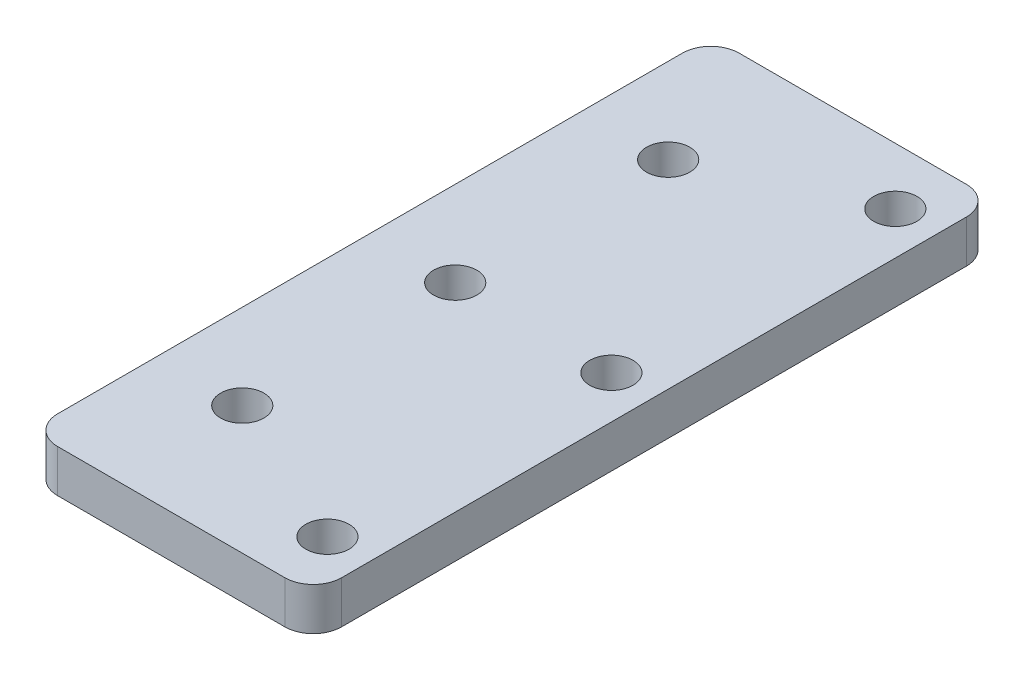
ISO-10303-21;
HEADER;
FILE_DESCRIPTION(('STEP AP214'),'2;1');
FILE_NAME('part.step','',(''),(''),'','','');
FILE_SCHEMA(('AUTOMOTIVE_DESIGN { 1 0 10303 214 1 1 1 1 }'));
ENDSEC;
DATA;
#1=APPLICATION_CONTEXT('core data for automotive mechanical design processes');
#2=APPLICATION_PROTOCOL_DEFINITION('international standard','automotive_design',2000,#1);
#3=PRODUCT_CONTEXT('',#1,'mechanical');
#4=PRODUCT('Part','Part','',(#3));
#5=PRODUCT_RELATED_PRODUCT_CATEGORY('part','',(#4));
#6=PRODUCT_DEFINITION_FORMATION('','',#4);
#7=PRODUCT_DEFINITION_CONTEXT('part definition',#1,'design');
#8=PRODUCT_DEFINITION('design','',#6,#7);
#9=PRODUCT_DEFINITION_SHAPE('','',#8);
#10=(LENGTH_UNIT() NAMED_UNIT(*) SI_UNIT(.MILLI.,.METRE.));
#11=(NAMED_UNIT(*) PLANE_ANGLE_UNIT() SI_UNIT($,.RADIAN.));
#12=(NAMED_UNIT(*) SI_UNIT($,.STERADIAN.) SOLID_ANGLE_UNIT());
#13=UNCERTAINTY_MEASURE_WITH_UNIT(LENGTH_MEASURE(1.E-05),#10,'distance_accuracy_value','');
#14=(GEOMETRIC_REPRESENTATION_CONTEXT(3) GLOBAL_UNCERTAINTY_ASSIGNED_CONTEXT((#13)) GLOBAL_UNIT_ASSIGNED_CONTEXT((#10,
#11,#12)) REPRESENTATION_CONTEXT('',''));
#15=CARTESIAN_POINT('',(0.,0.,0.));
#16=DIRECTION('',(0.,0.,1.));
#17=DIRECTION('',(1.,0.,0.));
#18=AXIS2_PLACEMENT_3D('',#15,#16,#17);
#19=CARTESIAN_POINT('',(10.,3.,24.));
#20=DIRECTION('',(-1.,0.,0.));
#21=DIRECTION('',(0.,0.,1.));
#22=AXIS2_PLACEMENT_3D('',#19,#20,#21);
#23=PLANE('',#22);
#24=DIRECTION('',(0.,0.,-1.));
#25=VECTOR('',#24,1.);
#26=CARTESIAN_POINT('',(10.,3.,24.));
#27=LINE('',#26,#25);
#28=CARTESIAN_POINT('',(10.,3.,22.));
#29=VERTEX_POINT('',#28);
#30=CARTESIAN_POINT('',(10.,3.,-22.));
#31=VERTEX_POINT('',#30);
#32=EDGE_CURVE('E130',#29,#31,#27,.T.);
#33=ORIENTED_EDGE('',*,*,#32,.F.);
#34=DIRECTION('',(0.,-1.,0.));
#35=VECTOR('',#34,1.);
#36=CARTESIAN_POINT('',(10.,3.,22.));
#37=LINE('',#36,#35);
#38=CARTESIAN_POINT('',(10.,0.,22.));
#39=VERTEX_POINT('',#38);
#40=EDGE_CURVE('E114',#29,#39,#37,.T.);
#41=ORIENTED_EDGE('',*,*,#40,.T.);
#42=DIRECTION('',(0.,0.,-1.));
#43=VECTOR('',#42,1.);
#44=CARTESIAN_POINT('',(10.,0.,24.));
#45=LINE('',#44,#43);
#46=CARTESIAN_POINT('',(10.,0.,-22.));
#47=VERTEX_POINT('',#46);
#48=EDGE_CURVE('E127',#39,#47,#45,.T.);
#49=ORIENTED_EDGE('',*,*,#48,.T.);
#50=DIRECTION('',(0.,-1.,0.));
#51=VECTOR('',#50,1.);
#52=CARTESIAN_POINT('',(10.,3.,-22.));
#53=LINE('',#52,#51);
#54=EDGE_CURVE('E133',#47,#31,#53,.F.);
#55=ORIENTED_EDGE('',*,*,#54,.T.);
#56=EDGE_LOOP('',(#33,#41,#49,#55));
#57=FACE_BOUND('',#56,.T.);
#58=ADVANCED_FACE('F42',(#57),#23,.F.);
#59=CARTESIAN_POINT('',(-10.,3.,-24.));
#60=DIRECTION('',(0.,0.,1.));
#61=DIRECTION('',(1.,0.,0.));
#62=AXIS2_PLACEMENT_3D('',#59,#60,#61);
#63=PLANE('',#62);
#64=DIRECTION('',(-1.,0.,0.));
#65=VECTOR('',#64,1.);
#66=CARTESIAN_POINT('',(-10.,3.,-24.));
#67=LINE('',#66,#65);
#68=CARTESIAN_POINT('',(8.,3.,-24.));
#69=VERTEX_POINT('',#68);
#70=CARTESIAN_POINT('',(-8.,3.,-24.));
#71=VERTEX_POINT('',#70);
#72=EDGE_CURVE('E193',#69,#71,#67,.T.);
#73=ORIENTED_EDGE('',*,*,#72,.F.);
#74=DIRECTION('',(0.,-1.,0.));
#75=VECTOR('',#74,1.);
#76=CARTESIAN_POINT('',(8.,3.,-24.));
#77=LINE('',#76,#75);
#78=CARTESIAN_POINT('',(8.,0.,-24.));
#79=VERTEX_POINT('',#78);
#80=EDGE_CURVE('E11',#69,#79,#77,.T.);
#81=ORIENTED_EDGE('',*,*,#80,.T.);
#82=DIRECTION('',(-1.,0.,0.));
#83=VECTOR('',#82,1.);
#84=CARTESIAN_POINT('',(-10.,0.,-24.));
#85=LINE('',#84,#83);
#86=CARTESIAN_POINT('',(-8.,0.,-24.));
#87=VERTEX_POINT('',#86);
#88=EDGE_CURVE('E139',#79,#87,#85,.T.);
#89=ORIENTED_EDGE('',*,*,#88,.T.);
#90=DIRECTION('',(0.,-1.,0.));
#91=VECTOR('',#90,1.);
#92=CARTESIAN_POINT('',(-8.,3.,-24.));
#93=LINE('',#92,#91);
#94=EDGE_CURVE('E51',#87,#71,#93,.F.);
#95=ORIENTED_EDGE('',*,*,#94,.T.);
#96=EDGE_LOOP('',(#73,#81,#89,#95));
#97=FACE_BOUND('',#96,.T.);
#98=ADVANCED_FACE('F192',(#97),#63,.F.);
#99=CARTESIAN_POINT('',(-10.,3.,24.));
#100=DIRECTION('',(1.,0.,0.));
#101=DIRECTION('',(0.,0.,-1.));
#102=AXIS2_PLACEMENT_3D('',#99,#100,#101);
#103=PLANE('',#102);
#104=DIRECTION('',(0.,0.,1.));
#105=VECTOR('',#104,1.);
#106=CARTESIAN_POINT('',(-10.,0.,24.));
#107=LINE('',#106,#105);
#108=CARTESIAN_POINT('',(-10.,0.,-22.));
#109=VERTEX_POINT('',#108);
#110=CARTESIAN_POINT('',(-10.,0.,22.));
#111=VERTEX_POINT('',#110);
#112=EDGE_CURVE('E145',#109,#111,#107,.T.);
#113=ORIENTED_EDGE('',*,*,#112,.T.);
#114=DIRECTION('',(0.,-1.,0.));
#115=VECTOR('',#114,1.);
#116=CARTESIAN_POINT('',(-10.,3.,22.));
#117=LINE('',#116,#115);
#118=CARTESIAN_POINT('',(-10.,3.,22.));
#119=VERTEX_POINT('',#118);
#120=EDGE_CURVE('E58',#111,#119,#117,.F.);
#121=ORIENTED_EDGE('',*,*,#120,.T.);
#122=DIRECTION('',(0.,0.,1.));
#123=VECTOR('',#122,1.);
#124=CARTESIAN_POINT('',(-10.,3.,24.));
#125=LINE('',#124,#123);
#126=CARTESIAN_POINT('',(-10.,3.,-22.));
#127=VERTEX_POINT('',#126);
#128=EDGE_CURVE('E200',#127,#119,#125,.T.);
#129=ORIENTED_EDGE('',*,*,#128,.F.);
#130=DIRECTION('',(0.,-1.,0.));
#131=VECTOR('',#130,1.);
#132=CARTESIAN_POINT('',(-10.,3.,-22.));
#133=LINE('',#132,#131);
#134=EDGE_CURVE('E183',#127,#109,#133,.T.);
#135=ORIENTED_EDGE('',*,*,#134,.T.);
#136=EDGE_LOOP('',(#113,#121,#129,#135));
#137=FACE_BOUND('',#136,.T.);
#138=ADVANCED_FACE('F204',(#137),#103,.F.);
#139=CARTESIAN_POINT('',(-10.,3.,24.));
#140=DIRECTION('',(0.,0.,-1.));
#141=DIRECTION('',(-1.,0.,0.));
#142=AXIS2_PLACEMENT_3D('',#139,#140,#141);
#143=PLANE('',#142);
#144=DIRECTION('',(1.,0.,0.));
#145=VECTOR('',#144,1.);
#146=CARTESIAN_POINT('',(-10.,0.,24.));
#147=LINE('',#146,#145);
#148=CARTESIAN_POINT('',(-8.,0.,24.));
#149=VERTEX_POINT('',#148);
#150=CARTESIAN_POINT('',(8.,0.,24.));
#151=VERTEX_POINT('',#150);
#152=EDGE_CURVE('E156',#149,#151,#147,.T.);
#153=ORIENTED_EDGE('',*,*,#152,.T.);
#154=DIRECTION('',(0.,-1.,0.));
#155=VECTOR('',#154,1.);
#156=CARTESIAN_POINT('',(8.,3.,24.));
#157=LINE('',#156,#155);
#158=CARTESIAN_POINT('',(8.,3.,24.));
#159=VERTEX_POINT('',#158);
#160=EDGE_CURVE('E115',#151,#159,#157,.F.);
#161=ORIENTED_EDGE('',*,*,#160,.T.);
#162=DIRECTION('',(1.,0.,0.));
#163=VECTOR('',#162,1.);
#164=CARTESIAN_POINT('',(-10.,3.,24.));
#165=LINE('',#164,#163);
#166=CARTESIAN_POINT('',(-8.,3.,24.));
#167=VERTEX_POINT('',#166);
#168=EDGE_CURVE('E151',#167,#159,#165,.T.);
#169=ORIENTED_EDGE('',*,*,#168,.F.);
#170=DIRECTION('',(0.,-1.,0.));
#171=VECTOR('',#170,1.);
#172=CARTESIAN_POINT('',(-8.,3.,24.));
#173=LINE('',#172,#171);
#174=EDGE_CURVE('E121',#167,#149,#173,.T.);
#175=ORIENTED_EDGE('',*,*,#174,.T.);
#176=EDGE_LOOP('',(#153,#161,#169,#175));
#177=FACE_BOUND('',#176,.T.);
#178=ADVANCED_FACE('F211',(#177),#143,.F.);
#179=CARTESIAN_POINT('',(0.,3.,0.));
#180=DIRECTION('',(0.,-1.,0.));
#181=DIRECTION('',(0.,0.,-1.));
#182=AXIS2_PLACEMENT_3D('',#179,#180,#181);
#183=PLANE('',#182);
#184=CARTESIAN_POINT('',(7.,3.,20.));
#185=DIRECTION('',(0.,1.,0.));
#186=DIRECTION('',(0.,0.,-1.));
#187=AXIS2_PLACEMENT_3D('',#184,#185,#186);
#188=CIRCLE('',#187,1.525);
#189=CARTESIAN_POINT('',(7.,3.,18.475));
#190=VERTEX_POINT('',#189);
#191=EDGE_CURVE('E241',#190,#190,#188,.T.);
#192=ORIENTED_EDGE('',*,*,#191,.F.);
#193=EDGE_LOOP('',(#192));
#194=FACE_BOUND('',#193,.T.);
#195=CARTESIAN_POINT('',(-4.,3.,-15.));
#196=DIRECTION('',(0.,1.,0.));
#197=DIRECTION('',(0.,0.,1.));
#198=AXIS2_PLACEMENT_3D('',#195,#196,#197);
#199=CIRCLE('',#198,1.525);
#200=CARTESIAN_POINT('',(-4.,3.,-13.475));
#201=VERTEX_POINT('',#200);
#202=EDGE_CURVE('E226',#201,#201,#199,.T.);
#203=ORIENTED_EDGE('',*,*,#202,.F.);
#204=EDGE_LOOP('',(#203));
#205=FACE_BOUND('',#204,.T.);
#206=CARTESIAN_POINT('',(-4.,3.,0.));
#207=DIRECTION('',(0.,1.,0.));
#208=DIRECTION('',(0.,0.,1.));
#209=AXIS2_PLACEMENT_3D('',#206,#207,#208);
#210=CIRCLE('',#209,1.525);
#211=CARTESIAN_POINT('',(-4.,3.,1.525));
#212=VERTEX_POINT('',#211);
#213=EDGE_CURVE('E225',#212,#212,#210,.T.);
#214=ORIENTED_EDGE('',*,*,#213,.F.);
#215=EDGE_LOOP('',(#214));
#216=FACE_BOUND('',#215,.T.);
#217=CARTESIAN_POINT('',(7.,3.,-20.));
#218=DIRECTION('',(0.,1.,0.));
#219=DIRECTION('',(0.,0.,1.));
#220=AXIS2_PLACEMENT_3D('',#217,#218,#219);
#221=CIRCLE('',#220,1.525);
#222=CARTESIAN_POINT('',(7.,3.,-18.475));
#223=VERTEX_POINT('',#222);
#224=EDGE_CURVE('E219',#223,#223,#221,.T.);
#225=ORIENTED_EDGE('',*,*,#224,.F.);
#226=EDGE_LOOP('',(#225));
#227=FACE_BOUND('',#226,.T.);
#228=CARTESIAN_POINT('',(-4.,3.,15.));
#229=DIRECTION('',(0.,1.,0.));
#230=DIRECTION('',(0.,0.,-1.));
#231=AXIS2_PLACEMENT_3D('',#228,#229,#230);
#232=CIRCLE('',#231,1.525);
#233=CARTESIAN_POINT('',(-4.,3.,13.475));
#234=VERTEX_POINT('',#233);
#235=EDGE_CURVE('E242',#234,#234,#232,.T.);
#236=ORIENTED_EDGE('',*,*,#235,.F.);
#237=EDGE_LOOP('',(#236));
#238=FACE_BOUND('',#237,.T.);
#239=CARTESIAN_POINT('',(7.,3.,0.));
#240=DIRECTION('',(0.,1.,0.));
#241=DIRECTION('',(0.,0.,1.));
#242=AXIS2_PLACEMENT_3D('',#239,#240,#241);
#243=CIRCLE('',#242,1.525);
#244=CARTESIAN_POINT('',(7.,3.,1.525));
#245=VERTEX_POINT('',#244);
#246=EDGE_CURVE('E148',#245,#245,#243,.T.);
#247=ORIENTED_EDGE('',*,*,#246,.F.);
#248=EDGE_LOOP('',(#247));
#249=FACE_BOUND('',#248,.T.);
#250=ORIENTED_EDGE('',*,*,#168,.T.);
#251=CARTESIAN_POINT('',(8.,3.,22.));
#252=DIRECTION('',(0.,-1.,0.));
#253=DIRECTION('',(0.,0.,-1.));
#254=AXIS2_PLACEMENT_3D('',#251,#252,#253);
#255=CIRCLE('',#254,2.);
#256=EDGE_CURVE('E180',#159,#29,#255,.F.);
#257=ORIENTED_EDGE('',*,*,#256,.T.);
#258=ORIENTED_EDGE('',*,*,#32,.T.);
#259=CARTESIAN_POINT('',(8.,3.,-22.));
#260=DIRECTION('',(0.,-1.,0.));
#261=DIRECTION('',(0.,0.,-1.));
#262=AXIS2_PLACEMENT_3D('',#259,#260,#261);
#263=CIRCLE('',#262,2.);
#264=EDGE_CURVE('E174',#31,#69,#263,.F.);
#265=ORIENTED_EDGE('',*,*,#264,.T.);
#266=ORIENTED_EDGE('',*,*,#72,.T.);
#267=CARTESIAN_POINT('',(-8.,3.,-22.));
#268=DIRECTION('',(0.,-1.,0.));
#269=DIRECTION('',(0.,0.,-1.));
#270=AXIS2_PLACEMENT_3D('',#267,#268,#269);
#271=CIRCLE('',#270,2.);
#272=EDGE_CURVE('E65',#71,#127,#271,.F.);
#273=ORIENTED_EDGE('',*,*,#272,.T.);
#274=ORIENTED_EDGE('',*,*,#128,.T.);
#275=CARTESIAN_POINT('',(-8.,3.,22.));
#276=DIRECTION('',(0.,-1.,0.));
#277=DIRECTION('',(0.,0.,-1.));
#278=AXIS2_PLACEMENT_3D('',#275,#276,#277);
#279=CIRCLE('',#278,2.);
#280=EDGE_CURVE('E177',#119,#167,#279,.F.);
#281=ORIENTED_EDGE('',*,*,#280,.T.);
#282=EDGE_LOOP('',(#250,#257,#258,#265,#266,#273,#274,#281));
#283=FACE_BOUND('',#282,.T.);
#284=ADVANCED_FACE('F197',(#194,#205,#216,#227,#238,#249,#283),#183,.F.);
#285=CARTESIAN_POINT('',(0.,0.,0.));
#286=DIRECTION('',(0.,-1.,0.));
#287=DIRECTION('',(0.,0.,-1.));
#288=AXIS2_PLACEMENT_3D('',#285,#286,#287);
#289=PLANE('',#288);
#290=CARTESIAN_POINT('',(7.,0.,20.));
#291=DIRECTION('',(0.,1.,0.));
#292=DIRECTION('',(0.,0.,-1.));
#293=AXIS2_PLACEMENT_3D('',#290,#291,#292);
#294=CIRCLE('',#293,1.525);
#295=CARTESIAN_POINT('',(7.,0.,18.475));
#296=VERTEX_POINT('',#295);
#297=EDGE_CURVE('E237',#296,#296,#294,.T.);
#298=ORIENTED_EDGE('',*,*,#297,.T.);
#299=EDGE_LOOP('',(#298));
#300=FACE_BOUND('',#299,.T.);
#301=CARTESIAN_POINT('',(-4.,0.,-15.));
#302=DIRECTION('',(0.,1.,0.));
#303=DIRECTION('',(0.,0.,1.));
#304=AXIS2_PLACEMENT_3D('',#301,#302,#303);
#305=CIRCLE('',#304,1.525);
#306=CARTESIAN_POINT('',(-4.,0.,-13.475));
#307=VERTEX_POINT('',#306);
#308=EDGE_CURVE('E246',#307,#307,#305,.T.);
#309=ORIENTED_EDGE('',*,*,#308,.T.);
#310=EDGE_LOOP('',(#309));
#311=FACE_BOUND('',#310,.T.);
#312=CARTESIAN_POINT('',(-4.,0.,0.));
#313=DIRECTION('',(0.,1.,0.));
#314=DIRECTION('',(0.,0.,1.));
#315=AXIS2_PLACEMENT_3D('',#312,#313,#314);
#316=CIRCLE('',#315,1.525);
#317=CARTESIAN_POINT('',(-4.,0.,1.525));
#318=VERTEX_POINT('',#317);
#319=EDGE_CURVE('E221',#318,#318,#316,.T.);
#320=ORIENTED_EDGE('',*,*,#319,.T.);
#321=EDGE_LOOP('',(#320));
#322=FACE_BOUND('',#321,.T.);
#323=CARTESIAN_POINT('',(7.,0.,-20.));
#324=DIRECTION('',(0.,1.,0.));
#325=DIRECTION('',(0.,0.,1.));
#326=AXIS2_PLACEMENT_3D('',#323,#324,#325);
#327=CIRCLE('',#326,1.525);
#328=CARTESIAN_POINT('',(7.,0.,-18.475));
#329=VERTEX_POINT('',#328);
#330=EDGE_CURVE('E230',#329,#329,#327,.T.);
#331=ORIENTED_EDGE('',*,*,#330,.T.);
#332=EDGE_LOOP('',(#331));
#333=FACE_BOUND('',#332,.T.);
#334=CARTESIAN_POINT('',(-4.,0.,15.));
#335=DIRECTION('',(0.,1.,0.));
#336=DIRECTION('',(0.,0.,-1.));
#337=AXIS2_PLACEMENT_3D('',#334,#335,#336);
#338=CIRCLE('',#337,1.525);
#339=CARTESIAN_POINT('',(-4.,0.,13.475));
#340=VERTEX_POINT('',#339);
#341=EDGE_CURVE('E253',#340,#340,#338,.T.);
#342=ORIENTED_EDGE('',*,*,#341,.T.);
#343=EDGE_LOOP('',(#342));
#344=FACE_BOUND('',#343,.T.);
#345=CARTESIAN_POINT('',(7.,0.,0.));
#346=DIRECTION('',(0.,1.,0.));
#347=DIRECTION('',(0.,0.,1.));
#348=AXIS2_PLACEMENT_3D('',#345,#346,#347);
#349=CIRCLE('',#348,1.525);
#350=CARTESIAN_POINT('',(7.,0.,1.525));
#351=VERTEX_POINT('',#350);
#352=EDGE_CURVE('E140',#351,#351,#349,.T.);
#353=ORIENTED_EDGE('',*,*,#352,.T.);
#354=EDGE_LOOP('',(#353));
#355=FACE_BOUND('',#354,.T.);
#356=ORIENTED_EDGE('',*,*,#48,.F.);
#357=CARTESIAN_POINT('',(8.,0.,22.));
#358=DIRECTION('',(0.,-1.,0.));
#359=DIRECTION('',(0.,0.,-1.));
#360=AXIS2_PLACEMENT_3D('',#357,#358,#359);
#361=CIRCLE('',#360,2.);
#362=EDGE_CURVE('E110',#39,#151,#361,.T.);
#363=ORIENTED_EDGE('',*,*,#362,.T.);
#364=ORIENTED_EDGE('',*,*,#152,.F.);
#365=CARTESIAN_POINT('',(-8.,0.,22.));
#366=DIRECTION('',(0.,-1.,0.));
#367=DIRECTION('',(0.,0.,-1.));
#368=AXIS2_PLACEMENT_3D('',#365,#366,#367);
#369=CIRCLE('',#368,2.);
#370=EDGE_CURVE('E122',#149,#111,#369,.T.);
#371=ORIENTED_EDGE('',*,*,#370,.T.);
#372=ORIENTED_EDGE('',*,*,#112,.F.);
#373=CARTESIAN_POINT('',(-8.,0.,-22.));
#374=DIRECTION('',(0.,-1.,0.));
#375=DIRECTION('',(0.,0.,-1.));
#376=AXIS2_PLACEMENT_3D('',#373,#374,#375);
#377=CIRCLE('',#376,2.);
#378=EDGE_CURVE('E132',#109,#87,#377,.T.);
#379=ORIENTED_EDGE('',*,*,#378,.T.);
#380=ORIENTED_EDGE('',*,*,#88,.F.);
#381=CARTESIAN_POINT('',(8.,0.,-22.));
#382=DIRECTION('',(0.,-1.,0.));
#383=DIRECTION('',(0.,0.,-1.));
#384=AXIS2_PLACEMENT_3D('',#381,#382,#383);
#385=CIRCLE('',#384,2.);
#386=EDGE_CURVE('E137',#79,#47,#385,.T.);
#387=ORIENTED_EDGE('',*,*,#386,.T.);
#388=EDGE_LOOP('',(#356,#363,#364,#371,#372,#379,#380,#387));
#389=FACE_BOUND('',#388,.T.);
#390=ADVANCED_FACE('F135',(#300,#311,#322,#333,#344,#355,#389),#289,.T.);
#391=CARTESIAN_POINT('',(7.,0.,0.));
#392=DIRECTION('',(0.,1.,0.));
#393=DIRECTION('',(0.,0.,1.));
#394=AXIS2_PLACEMENT_3D('',#391,#392,#393);
#395=CYLINDRICAL_SURFACE('',#394,1.525);
#396=ORIENTED_EDGE('',*,*,#352,.F.);
#397=EDGE_LOOP('',(#396));
#398=FACE_BOUND('',#397,.T.);
#399=ORIENTED_EDGE('',*,*,#246,.T.);
#400=EDGE_LOOP('',(#399));
#401=FACE_BOUND('',#400,.T.);
#402=ADVANCED_FACE('F269',(#398,#401),#395,.F.);
#403=CARTESIAN_POINT('',(-4.,0.,15.));
#404=DIRECTION('',(0.,1.,0.));
#405=DIRECTION('',(0.,0.,1.));
#406=AXIS2_PLACEMENT_3D('',#403,#404,#405);
#407=CYLINDRICAL_SURFACE('',#406,1.525);
#408=ORIENTED_EDGE('',*,*,#341,.F.);
#409=EDGE_LOOP('',(#408));
#410=FACE_BOUND('',#409,.T.);
#411=ORIENTED_EDGE('',*,*,#235,.T.);
#412=EDGE_LOOP('',(#411));
#413=FACE_BOUND('',#412,.T.);
#414=ADVANCED_FACE('F261',(#410,#413),#407,.F.);
#415=CARTESIAN_POINT('',(7.,0.,-20.));
#416=DIRECTION('',(0.,1.,0.));
#417=DIRECTION('',(0.,0.,1.));
#418=AXIS2_PLACEMENT_3D('',#415,#416,#417);
#419=CYLINDRICAL_SURFACE('',#418,1.525);
#420=ORIENTED_EDGE('',*,*,#330,.F.);
#421=EDGE_LOOP('',(#420));
#422=FACE_BOUND('',#421,.T.);
#423=ORIENTED_EDGE('',*,*,#224,.T.);
#424=EDGE_LOOP('',(#423));
#425=FACE_BOUND('',#424,.T.);
#426=ADVANCED_FACE('F277',(#422,#425),#419,.F.);
#427=CARTESIAN_POINT('',(-4.,0.,0.));
#428=DIRECTION('',(0.,1.,0.));
#429=DIRECTION('',(0.,0.,1.));
#430=AXIS2_PLACEMENT_3D('',#427,#428,#429);
#431=CYLINDRICAL_SURFACE('',#430,1.525);
#432=ORIENTED_EDGE('',*,*,#319,.F.);
#433=EDGE_LOOP('',(#432));
#434=FACE_BOUND('',#433,.T.);
#435=ORIENTED_EDGE('',*,*,#213,.T.);
#436=EDGE_LOOP('',(#435));
#437=FACE_BOUND('',#436,.T.);
#438=ADVANCED_FACE('F388',(#434,#437),#431,.F.);
#439=CARTESIAN_POINT('',(-4.,0.,-15.));
#440=DIRECTION('',(0.,1.,0.));
#441=DIRECTION('',(0.,0.,1.));
#442=AXIS2_PLACEMENT_3D('',#439,#440,#441);
#443=CYLINDRICAL_SURFACE('',#442,1.525);
#444=ORIENTED_EDGE('',*,*,#308,.F.);
#445=EDGE_LOOP('',(#444));
#446=FACE_BOUND('',#445,.T.);
#447=ORIENTED_EDGE('',*,*,#202,.T.);
#448=EDGE_LOOP('',(#447));
#449=FACE_BOUND('',#448,.T.);
#450=ADVANCED_FACE('F377',(#446,#449),#443,.F.);
#451=CARTESIAN_POINT('',(7.,0.,20.));
#452=DIRECTION('',(0.,1.,0.));
#453=DIRECTION('',(0.,0.,1.));
#454=AXIS2_PLACEMENT_3D('',#451,#452,#453);
#455=CYLINDRICAL_SURFACE('',#454,1.525);
#456=ORIENTED_EDGE('',*,*,#297,.F.);
#457=EDGE_LOOP('',(#456));
#458=FACE_BOUND('',#457,.T.);
#459=ORIENTED_EDGE('',*,*,#191,.T.);
#460=EDGE_LOOP('',(#459));
#461=FACE_BOUND('',#460,.T.);
#462=ADVANCED_FACE('F294',(#458,#461),#455,.F.);
#463=CARTESIAN_POINT('',(8.,3.,22.));
#464=DIRECTION('',(0.,-1.,0.));
#465=DIRECTION('',(0.,0.,-1.));
#466=AXIS2_PLACEMENT_3D('',#463,#464,#465);
#467=CYLINDRICAL_SURFACE('',#466,2.);
#468=ORIENTED_EDGE('',*,*,#256,.F.);
#469=ORIENTED_EDGE('',*,*,#160,.F.);
#470=ORIENTED_EDGE('',*,*,#362,.F.);
#471=ORIENTED_EDGE('',*,*,#40,.F.);
#472=EDGE_LOOP('',(#468,#469,#470,#471));
#473=FACE_BOUND('',#472,.T.);
#474=ADVANCED_FACE('F113',(#473),#467,.T.);
#475=CARTESIAN_POINT('',(-8.,3.,22.));
#476=DIRECTION('',(0.,-1.,0.));
#477=DIRECTION('',(0.,0.,-1.));
#478=AXIS2_PLACEMENT_3D('',#475,#476,#477);
#479=CYLINDRICAL_SURFACE('',#478,2.);
#480=ORIENTED_EDGE('',*,*,#280,.F.);
#481=ORIENTED_EDGE('',*,*,#120,.F.);
#482=ORIENTED_EDGE('',*,*,#370,.F.);
#483=ORIENTED_EDGE('',*,*,#174,.F.);
#484=EDGE_LOOP('',(#480,#481,#482,#483));
#485=FACE_BOUND('',#484,.T.);
#486=ADVANCED_FACE('F208',(#485),#479,.T.);
#487=CARTESIAN_POINT('',(8.,3.,-22.));
#488=DIRECTION('',(0.,-1.,0.));
#489=DIRECTION('',(0.,0.,-1.));
#490=AXIS2_PLACEMENT_3D('',#487,#488,#489);
#491=CYLINDRICAL_SURFACE('',#490,2.);
#492=ORIENTED_EDGE('',*,*,#264,.F.);
#493=ORIENTED_EDGE('',*,*,#54,.F.);
#494=ORIENTED_EDGE('',*,*,#386,.F.);
#495=ORIENTED_EDGE('',*,*,#80,.F.);
#496=EDGE_LOOP('',(#492,#493,#494,#495));
#497=FACE_BOUND('',#496,.T.);
#498=ADVANCED_FACE('F296',(#497),#491,.T.);
#499=CARTESIAN_POINT('',(-8.,3.,-22.));
#500=DIRECTION('',(0.,-1.,0.));
#501=DIRECTION('',(0.,0.,-1.));
#502=AXIS2_PLACEMENT_3D('',#499,#500,#501);
#503=CYLINDRICAL_SURFACE('',#502,2.);
#504=ORIENTED_EDGE('',*,*,#272,.F.);
#505=ORIENTED_EDGE('',*,*,#94,.F.);
#506=ORIENTED_EDGE('',*,*,#378,.F.);
#507=ORIENTED_EDGE('',*,*,#134,.F.);
#508=EDGE_LOOP('',(#504,#505,#506,#507));
#509=FACE_BOUND('',#508,.T.);
#510=ADVANCED_FACE('F44',(#509),#503,.T.);
#511=CLOSED_SHELL('',(#58,#98,#138,#178,#284,#390,#402,#414,#426,#438,#450,#462,#474,#486,#498,#510));
#512=MANIFOLD_SOLID_BREP('B2',#511);
#513=ADVANCED_BREP_SHAPE_REPRESENTATION('',(#18,#512),#14);
#514=SHAPE_DEFINITION_REPRESENTATION(#9,#513);
ENDSEC;
END-ISO-10303-21;
